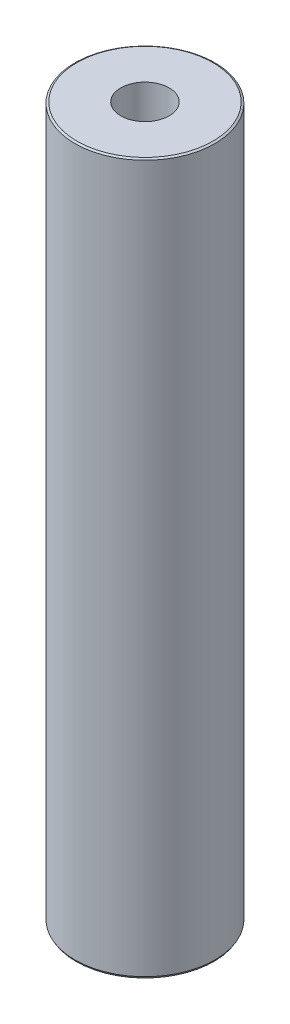
ISO-10303-21;
HEADER;
FILE_DESCRIPTION(('STEP AP214'),'2;1');
FILE_NAME('part.step','',(''),(''),'','','');
FILE_SCHEMA(('AUTOMOTIVE_DESIGN { 1 0 10303 214 1 1 1 1 }'));
ENDSEC;
DATA;
#1=APPLICATION_CONTEXT('core data for automotive mechanical design processes');
#2=APPLICATION_PROTOCOL_DEFINITION('international standard','automotive_design',2000,#1);
#3=PRODUCT_CONTEXT('',#1,'mechanical');
#4=PRODUCT('Part','Part','',(#3));
#5=PRODUCT_RELATED_PRODUCT_CATEGORY('part','',(#4));
#6=PRODUCT_DEFINITION_FORMATION('','',#4);
#7=PRODUCT_DEFINITION_CONTEXT('part definition',#1,'design');
#8=PRODUCT_DEFINITION('design','',#6,#7);
#9=PRODUCT_DEFINITION_SHAPE('','',#8);
#10=(LENGTH_UNIT() NAMED_UNIT(*) SI_UNIT(.MILLI.,.METRE.));
#11=(NAMED_UNIT(*) PLANE_ANGLE_UNIT() SI_UNIT($,.RADIAN.));
#12=(NAMED_UNIT(*) SI_UNIT($,.STERADIAN.) SOLID_ANGLE_UNIT());
#13=UNCERTAINTY_MEASURE_WITH_UNIT(LENGTH_MEASURE(1.E-05),#10,'distance_accuracy_value','');
#14=(GEOMETRIC_REPRESENTATION_CONTEXT(3) GLOBAL_UNCERTAINTY_ASSIGNED_CONTEXT((#13)) GLOBAL_UNIT_ASSIGNED_CONTEXT((#10,
#11,#12)) REPRESENTATION_CONTEXT('',''));
#15=CARTESIAN_POINT('',(0.,0.,0.));
#16=DIRECTION('',(0.,0.,1.));
#17=DIRECTION('',(1.,0.,0.));
#18=AXIS2_PLACEMENT_3D('',#15,#16,#17);
#19=CARTESIAN_POINT('',(0.,532.55206091256,0.));
#20=DIRECTION('',(0.,-1.,0.));
#21=DIRECTION('',(0.,0.,-1.));
#22=AXIS2_PLACEMENT_3D('',#19,#20,#21);
#23=CYLINDRICAL_SURFACE('',#22,52.5);
#24=CARTESIAN_POINT('',(0.,531.713854925389,0.));
#25=DIRECTION('',(0.,1.,0.));
#26=DIRECTION('',(0.,0.,1.));
#27=AXIS2_PLACEMENT_3D('',#24,#25,#26);
#28=CIRCLE('',#27,52.5);
#29=CARTESIAN_POINT('',(0.,531.713854925389,52.5));
#30=VERTEX_POINT('',#29);
#31=EDGE_CURVE('E50',#30,#30,#28,.F.);
#32=ORIENTED_EDGE('',*,*,#31,.T.);
#33=EDGE_LOOP('',(#32));
#34=FACE_BOUND('',#33,.T.);
#35=CARTESIAN_POINT('',(0.,1.45181535698824,0.));
#36=DIRECTION('',(0.,1.,0.));
#37=DIRECTION('',(0.,0.,1.));
#38=AXIS2_PLACEMENT_3D('',#35,#36,#37);
#39=CIRCLE('',#38,52.5);
#40=CARTESIAN_POINT('',(0.,1.45181535698824,52.5));
#41=VERTEX_POINT('',#40);
#42=EDGE_CURVE('E51',#41,#41,#39,.T.);
#43=ORIENTED_EDGE('',*,*,#42,.T.);
#44=EDGE_LOOP('',(#43));
#45=FACE_BOUND('',#44,.T.);
#46=ADVANCED_FACE('F39',(#34,#45),#23,.T.);
#47=CARTESIAN_POINT('',(0.,532.55206091256,0.));
#48=DIRECTION('',(0.,1.,0.));
#49=DIRECTION('',(0.,0.,1.));
#50=AXIS2_PLACEMENT_3D('',#47,#48,#49);
#51=PLANE('',#50);
#52=CARTESIAN_POINT('',(0.,532.55206091256,0.));
#53=DIRECTION('',(0.,1.,0.));
#54=DIRECTION('',(0.,0.,1.));
#55=AXIS2_PLACEMENT_3D('',#52,#53,#54);
#56=CIRCLE('',#55,51.0481846430119);
#57=CARTESIAN_POINT('',(0.,532.55206091256,51.0481846430119));
#58=VERTEX_POINT('',#57);
#59=EDGE_CURVE('E54',#58,#58,#56,.T.);
#60=ORIENTED_EDGE('',*,*,#59,.T.);
#61=EDGE_LOOP('',(#60));
#62=FACE_BOUND('',#61,.T.);
#63=CARTESIAN_POINT('',(0.,532.55206091256,0.));
#64=DIRECTION('',(0.,1.,0.));
#65=DIRECTION('',(0.,0.,1.));
#66=AXIS2_PLACEMENT_3D('',#63,#64,#65);
#67=CIRCLE('',#66,18.1718172762514);
#68=CARTESIAN_POINT('',(0.,532.55206091256,18.1718172762514));
#69=VERTEX_POINT('',#68);
#70=EDGE_CURVE('E58',#69,#69,#67,.T.);
#71=ORIENTED_EDGE('',*,*,#70,.F.);
#72=EDGE_LOOP('',(#71));
#73=FACE_BOUND('',#72,.T.);
#74=ADVANCED_FACE('F69',(#62,#73),#51,.T.);
#75=CARTESIAN_POINT('',(0.,0.,0.));
#76=DIRECTION('',(0.,1.,0.));
#77=DIRECTION('',(0.,0.,1.));
#78=AXIS2_PLACEMENT_3D('',#75,#76,#77);
#79=PLANE('',#78);
#80=CARTESIAN_POINT('',(0.,0.,0.));
#81=DIRECTION('',(0.,1.,0.));
#82=DIRECTION('',(0.,0.,1.));
#83=AXIS2_PLACEMENT_3D('',#80,#81,#82);
#84=CIRCLE('',#83,51.6617940128292);
#85=CARTESIAN_POINT('',(0.,0.,51.6617940128292));
#86=VERTEX_POINT('',#85);
#87=EDGE_CURVE('E10',#86,#86,#84,.F.);
#88=ORIENTED_EDGE('',*,*,#87,.T.);
#89=EDGE_LOOP('',(#88));
#90=FACE_BOUND('',#89,.T.);
#91=CARTESIAN_POINT('',(0.,0.,0.));
#92=DIRECTION('',(0.,1.,0.));
#93=DIRECTION('',(0.,0.,1.));
#94=AXIS2_PLACEMENT_3D('',#91,#92,#93);
#95=CIRCLE('',#94,18.1718172762514);
#96=CARTESIAN_POINT('',(0.,0.,18.1718172762514));
#97=VERTEX_POINT('',#96);
#98=EDGE_CURVE('E63',#97,#97,#95,.T.);
#99=ORIENTED_EDGE('',*,*,#98,.T.);
#100=EDGE_LOOP('',(#99));
#101=FACE_BOUND('',#100,.T.);
#102=ADVANCED_FACE('F75',(#90,#101),#79,.F.);
#103=CARTESIAN_POINT('',(0.,532.55206091256,0.));
#104=DIRECTION('',(0.,-1.,0.));
#105=DIRECTION('',(0.,0.,-1.));
#106=AXIS2_PLACEMENT_3D('',#103,#104,#105);
#107=CYLINDRICAL_SURFACE('',#106,18.1718172762514);
#108=ORIENTED_EDGE('',*,*,#70,.T.);
#109=EDGE_LOOP('',(#108));
#110=FACE_BOUND('',#109,.T.);
#111=ORIENTED_EDGE('',*,*,#98,.F.);
#112=EDGE_LOOP('',(#111));
#113=FACE_BOUND('',#112,.T.);
#114=ADVANCED_FACE('F70',(#110,#113),#107,.F.);
#115=CARTESIAN_POINT('',(0.,532.55206091256,0.));
#116=DIRECTION('',(0.,-1.,0.));
#117=DIRECTION('',(0.,0.,-1.));
#118=AXIS2_PLACEMENT_3D('',#115,#116,#117);
#119=CONICAL_SURFACE('',#118,51.0481846430119,1.04719755119656);
#120=ORIENTED_EDGE('',*,*,#31,.F.);
#121=EDGE_LOOP('',(#120));
#122=FACE_BOUND('',#121,.T.);
#123=ORIENTED_EDGE('',*,*,#59,.F.);
#124=EDGE_LOOP('',(#123));
#125=FACE_BOUND('',#124,.T.);
#126=ADVANCED_FACE('F81',(#122,#125),#119,.T.);
#127=CARTESIAN_POINT('',(0.,1.45181535698824,0.));
#128=DIRECTION('',(0.,1.,0.));
#129=DIRECTION('',(0.,0.,1.));
#130=AXIS2_PLACEMENT_3D('',#127,#128,#129);
#131=CONICAL_SURFACE('',#130,52.5,0.523598775598305);
#132=ORIENTED_EDGE('',*,*,#87,.F.);
#133=EDGE_LOOP('',(#132));
#134=FACE_BOUND('',#133,.T.);
#135=ORIENTED_EDGE('',*,*,#42,.F.);
#136=EDGE_LOOP('',(#135));
#137=FACE_BOUND('',#136,.T.);
#138=ADVANCED_FACE('F45',(#134,#137),#131,.T.);
#139=CLOSED_SHELL('',(#46,#74,#102,#114,#126,#138));
#140=MANIFOLD_SOLID_BREP('B2',#139);
#141=ADVANCED_BREP_SHAPE_REPRESENTATION('',(#18,#140),#14);
#142=SHAPE_DEFINITION_REPRESENTATION(#9,#141);
ENDSEC;
END-ISO-10303-21;
